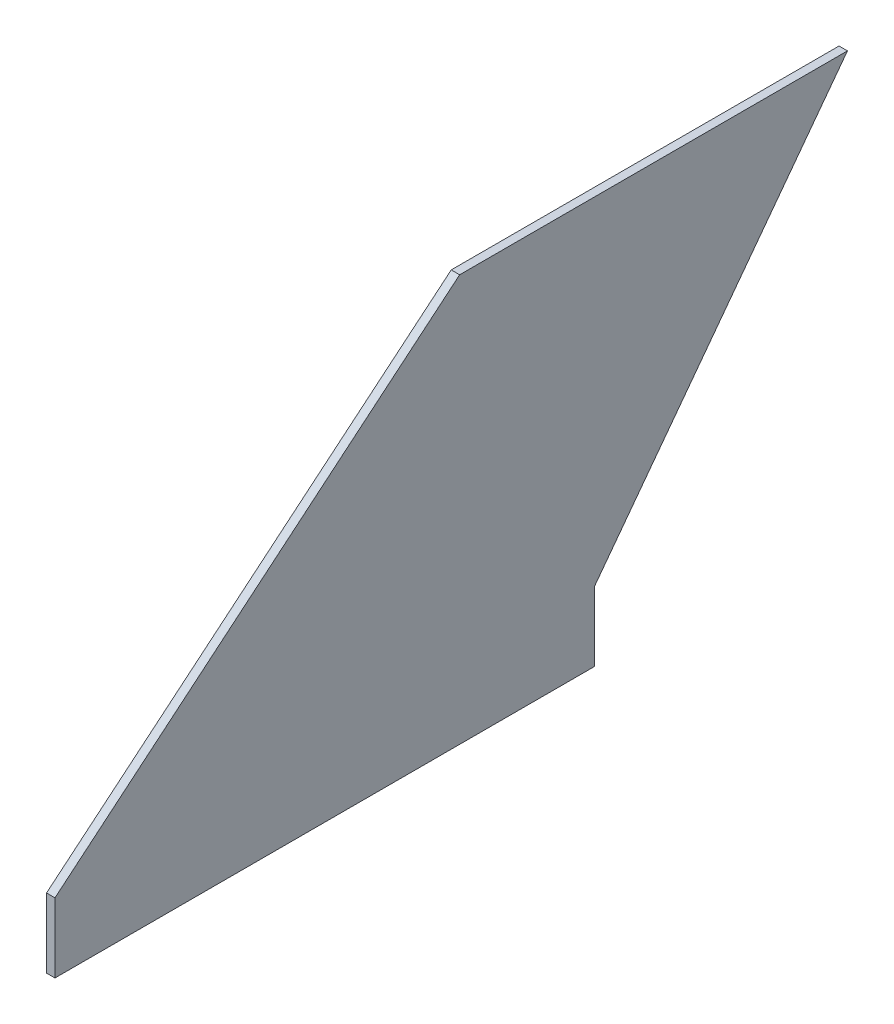
ISO-10303-21;
HEADER;
FILE_DESCRIPTION(('STEP AP214'),'2;1');
FILE_NAME('part.step','',(''),(''),'','','');
FILE_SCHEMA(('AUTOMOTIVE_DESIGN { 1 0 10303 214 1 1 1 1 }'));
ENDSEC;
DATA;
#1=APPLICATION_CONTEXT('core data for automotive mechanical design processes');
#2=APPLICATION_PROTOCOL_DEFINITION('international standard','automotive_design',2000,#1);
#3=PRODUCT_CONTEXT('',#1,'mechanical');
#4=PRODUCT('Part','Part','',(#3));
#5=PRODUCT_RELATED_PRODUCT_CATEGORY('part','',(#4));
#6=PRODUCT_DEFINITION_FORMATION('','',#4);
#7=PRODUCT_DEFINITION_CONTEXT('part definition',#1,'design');
#8=PRODUCT_DEFINITION('design','',#6,#7);
#9=PRODUCT_DEFINITION_SHAPE('','',#8);
#10=(LENGTH_UNIT() NAMED_UNIT(*) SI_UNIT(.MILLI.,.METRE.));
#11=(NAMED_UNIT(*) PLANE_ANGLE_UNIT() SI_UNIT($,.RADIAN.));
#12=(NAMED_UNIT(*) SI_UNIT($,.STERADIAN.) SOLID_ANGLE_UNIT());
#13=UNCERTAINTY_MEASURE_WITH_UNIT(LENGTH_MEASURE(1.E-05),#10,'distance_accuracy_value','');
#14=(GEOMETRIC_REPRESENTATION_CONTEXT(3) GLOBAL_UNCERTAINTY_ASSIGNED_CONTEXT((#13)) GLOBAL_UNIT_ASSIGNED_CONTEXT((#10,
#11,#12)) REPRESENTATION_CONTEXT('',''));
#15=CARTESIAN_POINT('',(0.,0.,0.));
#16=DIRECTION('',(0.,0.,1.));
#17=DIRECTION('',(1.,0.,0.));
#18=AXIS2_PLACEMENT_3D('',#15,#16,#17);
#19=CARTESIAN_POINT('',(3.175,127.,-298.45));
#20=DIRECTION('',(0.,0.6,0.8));
#21=DIRECTION('',(0.,-0.8,0.6));
#22=AXIS2_PLACEMENT_3D('',#19,#20,#21);
#23=PLANE('',#22);
#24=DIRECTION('',(0.,0.8,-0.6));
#25=VECTOR('',#24,1.);
#26=CARTESIAN_POINT('',(0.,127.,-298.45));
#27=LINE('',#26,#25);
#28=CARTESIAN_POINT('',(0.,0.,-203.2));
#29=VERTEX_POINT('',#28);
#30=CARTESIAN_POINT('',(0.,127.,-298.45));
#31=VERTEX_POINT('',#30);
#32=EDGE_CURVE('E123',#29,#31,#27,.T.);
#33=ORIENTED_EDGE('',*,*,#32,.T.);
#34=DIRECTION('',(-1.,0.,0.));
#35=VECTOR('',#34,1.);
#36=CARTESIAN_POINT('',(3.175,127.,-298.45));
#37=LINE('',#36,#35);
#38=CARTESIAN_POINT('',(3.175,127.,-298.45));
#39=VERTEX_POINT('',#38);
#40=EDGE_CURVE('E11',#39,#31,#37,.T.);
#41=ORIENTED_EDGE('',*,*,#40,.F.);
#42=DIRECTION('',(0.,0.8,-0.6));
#43=VECTOR('',#42,1.);
#44=CARTESIAN_POINT('',(3.175,127.,-298.45));
#45=LINE('',#44,#43);
#46=CARTESIAN_POINT('',(3.175,0.,-203.2));
#47=VERTEX_POINT('',#46);
#48=EDGE_CURVE('E133',#47,#39,#45,.T.);
#49=ORIENTED_EDGE('',*,*,#48,.F.);
#50=DIRECTION('',(-1.,0.,0.));
#51=VECTOR('',#50,1.);
#52=CARTESIAN_POINT('',(3.175,0.,-203.2));
#53=LINE('',#52,#51);
#54=EDGE_CURVE('E119',#47,#29,#53,.T.);
#55=ORIENTED_EDGE('',*,*,#54,.T.);
#56=EDGE_LOOP('',(#33,#41,#49,#55));
#57=FACE_BOUND('',#56,.T.);
#58=ADVANCED_FACE('F39',(#57),#23,.F.);
#59=CARTESIAN_POINT('',(3.175,127.,-152.4));
#60=DIRECTION('',(0.,-1.,0.));
#61=DIRECTION('',(0.,0.,-1.));
#62=AXIS2_PLACEMENT_3D('',#59,#60,#61);
#63=PLANE('',#62);
#64=DIRECTION('',(0.,0.,1.));
#65=VECTOR('',#64,1.);
#66=CARTESIAN_POINT('',(0.,127.,-152.4));
#67=LINE('',#66,#65);
#68=CARTESIAN_POINT('',(0.,127.,-152.4));
#69=VERTEX_POINT('',#68);
#70=EDGE_CURVE('E126',#31,#69,#67,.T.);
#71=ORIENTED_EDGE('',*,*,#70,.T.);
#72=DIRECTION('',(-1.,0.,0.));
#73=VECTOR('',#72,1.);
#74=CARTESIAN_POINT('',(3.175,127.,-152.4));
#75=LINE('',#74,#73);
#76=CARTESIAN_POINT('',(3.175,127.,-152.4));
#77=VERTEX_POINT('',#76);
#78=EDGE_CURVE('E47',#77,#69,#75,.T.);
#79=ORIENTED_EDGE('',*,*,#78,.F.);
#80=DIRECTION('',(0.,0.,1.));
#81=VECTOR('',#80,1.);
#82=CARTESIAN_POINT('',(3.175,127.,-152.4));
#83=LINE('',#82,#81);
#84=EDGE_CURVE('E92',#39,#77,#83,.T.);
#85=ORIENTED_EDGE('',*,*,#84,.F.);
#86=ORIENTED_EDGE('',*,*,#40,.T.);
#87=EDGE_LOOP('',(#71,#79,#85,#86));
#88=FACE_BOUND('',#87,.T.);
#89=ADVANCED_FACE('F157',(#88),#63,.F.);
#90=CARTESIAN_POINT('',(3.175,0.,0.));
#91=DIRECTION('',(0.,-0.768221279597376,-0.64018439966448));
#92=DIRECTION('',(0.,0.64018439966448,-0.768221279597376));
#93=AXIS2_PLACEMENT_3D('',#90,#91,#92);
#94=PLANE('',#93);
#95=DIRECTION('',(0.,-0.64018439966448,0.768221279597376));
#96=VECTOR('',#95,1.);
#97=CARTESIAN_POINT('',(0.,0.,0.));
#98=LINE('',#97,#96);
#99=CARTESIAN_POINT('',(0.,0.,0.));
#100=VERTEX_POINT('',#99);
#101=EDGE_CURVE('E128',#69,#100,#98,.T.);
#102=ORIENTED_EDGE('',*,*,#101,.T.);
#103=DIRECTION('',(-1.,0.,0.));
#104=VECTOR('',#103,1.);
#105=CARTESIAN_POINT('',(3.175,0.,0.));
#106=LINE('',#105,#104);
#107=CARTESIAN_POINT('',(3.175,0.,0.));
#108=VERTEX_POINT('',#107);
#109=EDGE_CURVE('E114',#108,#100,#106,.T.);
#110=ORIENTED_EDGE('',*,*,#109,.F.);
#111=DIRECTION('',(0.,-0.64018439966448,0.768221279597376));
#112=VECTOR('',#111,1.);
#113=CARTESIAN_POINT('',(3.175,0.,0.));
#114=LINE('',#113,#112);
#115=EDGE_CURVE('E105',#77,#108,#114,.T.);
#116=ORIENTED_EDGE('',*,*,#115,.F.);
#117=ORIENTED_EDGE('',*,*,#78,.T.);
#118=EDGE_LOOP('',(#102,#110,#116,#117));
#119=FACE_BOUND('',#118,.T.);
#120=ADVANCED_FACE('F139',(#119),#94,.F.);
#121=CARTESIAN_POINT('',(3.175,-26.1493,0.));
#122=DIRECTION('',(0.,0.,-1.));
#123=DIRECTION('',(-1.,0.,0.));
#124=AXIS2_PLACEMENT_3D('',#121,#122,#123);
#125=PLANE('',#124);
#126=DIRECTION('',(0.,-1.,0.));
#127=VECTOR('',#126,1.);
#128=CARTESIAN_POINT('',(0.,-26.1493,0.));
#129=LINE('',#128,#127);
#130=CARTESIAN_POINT('',(0.,-26.1493,0.));
#131=VERTEX_POINT('',#130);
#132=EDGE_CURVE('E113',#100,#131,#129,.T.);
#133=ORIENTED_EDGE('',*,*,#132,.T.);
#134=DIRECTION('',(-1.,0.,0.));
#135=VECTOR('',#134,1.);
#136=CARTESIAN_POINT('',(3.175,-26.1493,0.));
#137=LINE('',#136,#135);
#138=CARTESIAN_POINT('',(3.175,-26.1493,0.));
#139=VERTEX_POINT('',#138);
#140=EDGE_CURVE('E110',#139,#131,#137,.T.);
#141=ORIENTED_EDGE('',*,*,#140,.F.);
#142=DIRECTION('',(0.,-1.,0.));
#143=VECTOR('',#142,1.);
#144=CARTESIAN_POINT('',(3.175,-26.1493,0.));
#145=LINE('',#144,#143);
#146=EDGE_CURVE('E99',#108,#139,#145,.T.);
#147=ORIENTED_EDGE('',*,*,#146,.F.);
#148=ORIENTED_EDGE('',*,*,#109,.T.);
#149=EDGE_LOOP('',(#133,#141,#147,#148));
#150=FACE_BOUND('',#149,.T.);
#151=ADVANCED_FACE('F111',(#150),#125,.F.);
#152=CARTESIAN_POINT('',(3.175,-26.1493,0.));
#153=DIRECTION('',(0.,1.,0.));
#154=DIRECTION('',(0.,0.,1.));
#155=AXIS2_PLACEMENT_3D('',#152,#153,#154);
#156=PLANE('',#155);
#157=DIRECTION('',(0.,0.,-1.));
#158=VECTOR('',#157,1.);
#159=CARTESIAN_POINT('',(0.,-26.1493,0.));
#160=LINE('',#159,#158);
#161=CARTESIAN_POINT('',(0.,-26.1493,-203.2));
#162=VERTEX_POINT('',#161);
#163=EDGE_CURVE('E78',#131,#162,#160,.T.);
#164=ORIENTED_EDGE('',*,*,#163,.T.);
#165=DIRECTION('',(-1.,0.,0.));
#166=VECTOR('',#165,1.);
#167=CARTESIAN_POINT('',(3.175,-26.1493,-203.2));
#168=LINE('',#167,#166);
#169=CARTESIAN_POINT('',(3.175,-26.1493,-203.2));
#170=VERTEX_POINT('',#169);
#171=EDGE_CURVE('E115',#170,#162,#168,.T.);
#172=ORIENTED_EDGE('',*,*,#171,.F.);
#173=DIRECTION('',(0.,0.,-1.));
#174=VECTOR('',#173,1.);
#175=CARTESIAN_POINT('',(3.175,-26.1493,0.));
#176=LINE('',#175,#174);
#177=EDGE_CURVE('E103',#139,#170,#176,.T.);
#178=ORIENTED_EDGE('',*,*,#177,.F.);
#179=ORIENTED_EDGE('',*,*,#140,.T.);
#180=EDGE_LOOP('',(#164,#172,#178,#179));
#181=FACE_BOUND('',#180,.T.);
#182=ADVANCED_FACE('F117',(#181),#156,.F.);
#183=CARTESIAN_POINT('',(3.175,-26.1493,-203.2));
#184=DIRECTION('',(0.,0.,1.));
#185=DIRECTION('',(1.,0.,0.));
#186=AXIS2_PLACEMENT_3D('',#183,#184,#185);
#187=PLANE('',#186);
#188=DIRECTION('',(0.,1.,0.));
#189=VECTOR('',#188,1.);
#190=CARTESIAN_POINT('',(0.,-26.1493,-203.2));
#191=LINE('',#190,#189);
#192=EDGE_CURVE('E84',#162,#29,#191,.T.);
#193=ORIENTED_EDGE('',*,*,#192,.T.);
#194=ORIENTED_EDGE('',*,*,#54,.F.);
#195=DIRECTION('',(0.,1.,0.));
#196=VECTOR('',#195,1.);
#197=CARTESIAN_POINT('',(3.175,-26.1493,-203.2));
#198=LINE('',#197,#196);
#199=EDGE_CURVE('E55',#170,#47,#198,.T.);
#200=ORIENTED_EDGE('',*,*,#199,.F.);
#201=ORIENTED_EDGE('',*,*,#171,.T.);
#202=EDGE_LOOP('',(#193,#194,#200,#201));
#203=FACE_BOUND('',#202,.T.);
#204=ADVANCED_FACE('F146',(#203),#187,.F.);
#205=CARTESIAN_POINT('',(3.175,0.,0.));
#206=DIRECTION('',(1.,0.,0.));
#207=DIRECTION('',(0.,0.,-1.));
#208=AXIS2_PLACEMENT_3D('',#205,#206,#207);
#209=PLANE('',#208);
#210=ORIENTED_EDGE('',*,*,#48,.T.);
#211=ORIENTED_EDGE('',*,*,#84,.T.);
#212=ORIENTED_EDGE('',*,*,#115,.T.);
#213=ORIENTED_EDGE('',*,*,#146,.T.);
#214=ORIENTED_EDGE('',*,*,#177,.T.);
#215=ORIENTED_EDGE('',*,*,#199,.T.);
#216=EDGE_LOOP('',(#210,#211,#212,#213,#214,#215));
#217=FACE_BOUND('',#216,.T.);
#218=ADVANCED_FACE('F101',(#217),#209,.T.);
#219=CARTESIAN_POINT('',(0.,0.,0.));
#220=DIRECTION('',(1.,0.,0.));
#221=DIRECTION('',(0.,0.,-1.));
#222=AXIS2_PLACEMENT_3D('',#219,#220,#221);
#223=PLANE('',#222);
#224=ORIENTED_EDGE('',*,*,#32,.F.);
#225=ORIENTED_EDGE('',*,*,#192,.F.);
#226=ORIENTED_EDGE('',*,*,#163,.F.);
#227=ORIENTED_EDGE('',*,*,#132,.F.);
#228=ORIENTED_EDGE('',*,*,#101,.F.);
#229=ORIENTED_EDGE('',*,*,#70,.F.);
#230=EDGE_LOOP('',(#224,#225,#226,#227,#228,#229));
#231=FACE_BOUND('',#230,.T.);
#232=ADVANCED_FACE('F142',(#231),#223,.F.);
#233=CLOSED_SHELL('',(#58,#89,#120,#151,#182,#204,#218,#232));
#234=MANIFOLD_SOLID_BREP('B2',#233);
#235=ADVANCED_BREP_SHAPE_REPRESENTATION('',(#18,#234),#14);
#236=SHAPE_DEFINITION_REPRESENTATION(#9,#235);
ENDSEC;
END-ISO-10303-21;
